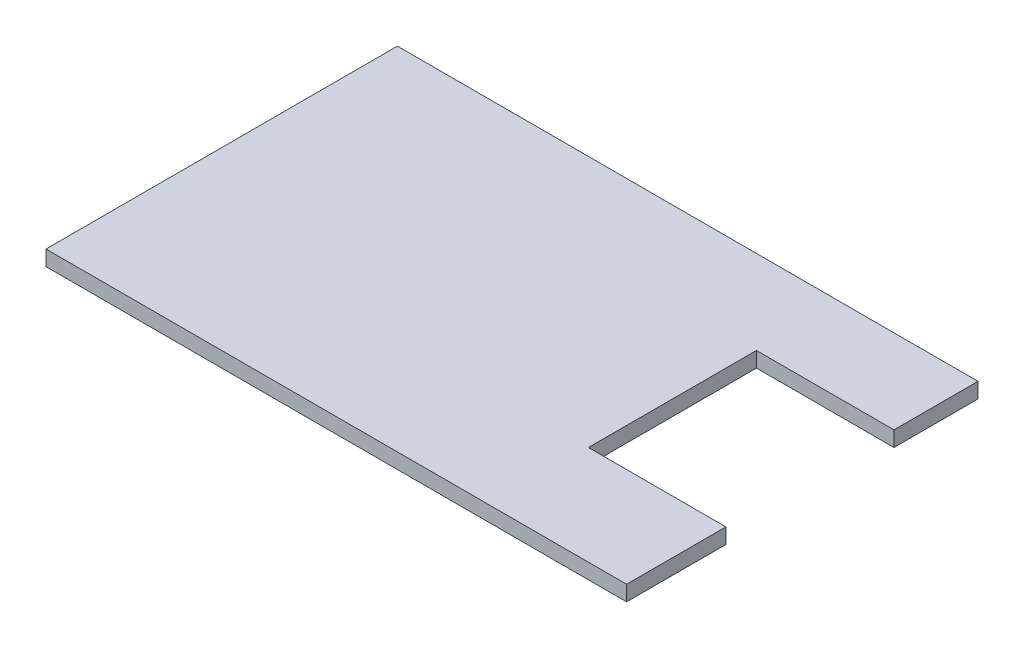
ISO-10303-21;
HEADER;
FILE_DESCRIPTION(('STEP AP214'),'2;1');
FILE_NAME('part.step','',(''),(''),'','','');
FILE_SCHEMA(('AUTOMOTIVE_DESIGN { 1 0 10303 214 1 1 1 1 }'));
ENDSEC;
DATA;
#1=APPLICATION_CONTEXT('core data for automotive mechanical design processes');
#2=APPLICATION_PROTOCOL_DEFINITION('international standard','automotive_design',2000,#1);
#3=PRODUCT_CONTEXT('',#1,'mechanical');
#4=PRODUCT('Part','Part','',(#3));
#5=PRODUCT_RELATED_PRODUCT_CATEGORY('part','',(#4));
#6=PRODUCT_DEFINITION_FORMATION('','',#4);
#7=PRODUCT_DEFINITION_CONTEXT('part definition',#1,'design');
#8=PRODUCT_DEFINITION('design','',#6,#7);
#9=PRODUCT_DEFINITION_SHAPE('','',#8);
#10=(LENGTH_UNIT() NAMED_UNIT(*) SI_UNIT(.MILLI.,.METRE.));
#11=(NAMED_UNIT(*) PLANE_ANGLE_UNIT() SI_UNIT($,.RADIAN.));
#12=(NAMED_UNIT(*) SI_UNIT($,.STERADIAN.) SOLID_ANGLE_UNIT());
#13=UNCERTAINTY_MEASURE_WITH_UNIT(LENGTH_MEASURE(1.E-05),#10,'distance_accuracy_value','');
#14=(GEOMETRIC_REPRESENTATION_CONTEXT(3) GLOBAL_UNCERTAINTY_ASSIGNED_CONTEXT((#13)) GLOBAL_UNIT_ASSIGNED_CONTEXT((#10,
#11,#12)) REPRESENTATION_CONTEXT('',''));
#15=CARTESIAN_POINT('',(0.,0.,0.));
#16=DIRECTION('',(0.,0.,1.));
#17=DIRECTION('',(1.,0.,0.));
#18=AXIS2_PLACEMENT_3D('',#15,#16,#17);
#19=CARTESIAN_POINT('',(0.,2.,0.));
#20=DIRECTION('',(1.,0.,0.));
#21=DIRECTION('',(0.,0.,-1.));
#22=AXIS2_PLACEMENT_3D('',#19,#20,#21);
#23=PLANE('',#22);
#24=DIRECTION('',(0.,0.,1.));
#25=VECTOR('',#24,1.);
#26=CARTESIAN_POINT('',(0.,0.,0.));
#27=LINE('',#26,#25);
#28=CARTESIAN_POINT('',(0.,0.,-46.));
#29=VERTEX_POINT('',#28);
#30=CARTESIAN_POINT('',(0.,0.,0.));
#31=VERTEX_POINT('',#30);
#32=EDGE_CURVE('E131',#29,#31,#27,.T.);
#33=ORIENTED_EDGE('',*,*,#32,.T.);
#34=DIRECTION('',(0.,-1.,0.));
#35=VECTOR('',#34,1.);
#36=CARTESIAN_POINT('',(0.,2.,0.));
#37=LINE('',#36,#35);
#38=CARTESIAN_POINT('',(0.,2.,0.));
#39=VERTEX_POINT('',#38);
#40=EDGE_CURVE('E11',#39,#31,#37,.T.);
#41=ORIENTED_EDGE('',*,*,#40,.F.);
#42=DIRECTION('',(0.,0.,1.));
#43=VECTOR('',#42,1.);
#44=CARTESIAN_POINT('',(0.,2.,0.));
#45=LINE('',#44,#43);
#46=CARTESIAN_POINT('',(0.,2.,-46.));
#47=VERTEX_POINT('',#46);
#48=EDGE_CURVE('E145',#47,#39,#45,.T.);
#49=ORIENTED_EDGE('',*,*,#48,.F.);
#50=DIRECTION('',(0.,-1.,0.));
#51=VECTOR('',#50,1.);
#52=CARTESIAN_POINT('',(0.,2.,-46.));
#53=LINE('',#52,#51);
#54=EDGE_CURVE('E127',#47,#29,#53,.T.);
#55=ORIENTED_EDGE('',*,*,#54,.T.);
#56=EDGE_LOOP('',(#33,#41,#49,#55));
#57=FACE_BOUND('',#56,.T.);
#58=ADVANCED_FACE('F35',(#57),#23,.F.);
#59=CARTESIAN_POINT('',(0.,2.,0.));
#60=DIRECTION('',(0.,0.,-1.));
#61=DIRECTION('',(-1.,0.,0.));
#62=AXIS2_PLACEMENT_3D('',#59,#60,#61);
#63=PLANE('',#62);
#64=DIRECTION('',(1.,0.,0.));
#65=VECTOR('',#64,1.);
#66=CARTESIAN_POINT('',(0.,0.,0.));
#67=LINE('',#66,#65);
#68=CARTESIAN_POINT('',(76.,0.,0.));
#69=VERTEX_POINT('',#68);
#70=EDGE_CURVE('E134',#31,#69,#67,.T.);
#71=ORIENTED_EDGE('',*,*,#70,.T.);
#72=DIRECTION('',(0.,-1.,0.));
#73=VECTOR('',#72,1.);
#74=CARTESIAN_POINT('',(76.,2.,0.));
#75=LINE('',#74,#73);
#76=CARTESIAN_POINT('',(76.,2.,0.));
#77=VERTEX_POINT('',#76);
#78=EDGE_CURVE('E43',#77,#69,#75,.T.);
#79=ORIENTED_EDGE('',*,*,#78,.F.);
#80=DIRECTION('',(1.,0.,0.));
#81=VECTOR('',#80,1.);
#82=CARTESIAN_POINT('',(0.,2.,0.));
#83=LINE('',#82,#81);
#84=EDGE_CURVE('E94',#39,#77,#83,.T.);
#85=ORIENTED_EDGE('',*,*,#84,.F.);
#86=ORIENTED_EDGE('',*,*,#40,.T.);
#87=EDGE_LOOP('',(#71,#79,#85,#86));
#88=FACE_BOUND('',#87,.T.);
#89=ADVANCED_FACE('F180',(#88),#63,.F.);
#90=CARTESIAN_POINT('',(76.,2.,0.));
#91=DIRECTION('',(-1.,0.,0.));
#92=DIRECTION('',(0.,0.,1.));
#93=AXIS2_PLACEMENT_3D('',#90,#91,#92);
#94=PLANE('',#93);
#95=DIRECTION('',(0.,0.,-1.));
#96=VECTOR('',#95,1.);
#97=CARTESIAN_POINT('',(76.,0.,0.));
#98=LINE('',#97,#96);
#99=CARTESIAN_POINT('',(76.,0.,-13.));
#100=VERTEX_POINT('',#99);
#101=EDGE_CURVE('E136',#69,#100,#98,.T.);
#102=ORIENTED_EDGE('',*,*,#101,.T.);
#103=DIRECTION('',(0.,-1.,0.));
#104=VECTOR('',#103,1.);
#105=CARTESIAN_POINT('',(76.,2.,-13.));
#106=LINE('',#105,#104);
#107=CARTESIAN_POINT('',(76.,2.,-13.));
#108=VERTEX_POINT('',#107);
#109=EDGE_CURVE('E152',#108,#100,#106,.T.);
#110=ORIENTED_EDGE('',*,*,#109,.F.);
#111=DIRECTION('',(0.,0.,-1.));
#112=VECTOR('',#111,1.);
#113=CARTESIAN_POINT('',(76.,2.,0.));
#114=LINE('',#113,#112);
#115=EDGE_CURVE('E160',#77,#108,#114,.T.);
#116=ORIENTED_EDGE('',*,*,#115,.F.);
#117=ORIENTED_EDGE('',*,*,#78,.T.);
#118=EDGE_LOOP('',(#102,#110,#116,#117));
#119=FACE_BOUND('',#118,.T.);
#120=ADVANCED_FACE('F158',(#119),#94,.F.);
#121=CARTESIAN_POINT('',(76.,2.,-13.));
#122=DIRECTION('',(0.,0.,1.));
#123=DIRECTION('',(1.,0.,0.));
#124=AXIS2_PLACEMENT_3D('',#121,#122,#123);
#125=PLANE('',#124);
#126=DIRECTION('',(-1.,0.,0.));
#127=VECTOR('',#126,1.);
#128=CARTESIAN_POINT('',(76.,0.,-13.));
#129=LINE('',#128,#127);
#130=CARTESIAN_POINT('',(58.,0.,-13.));
#131=VERTEX_POINT('',#130);
#132=EDGE_CURVE('E138',#100,#131,#129,.T.);
#133=ORIENTED_EDGE('',*,*,#132,.T.);
#134=DIRECTION('',(0.,-1.,0.));
#135=VECTOR('',#134,1.);
#136=CARTESIAN_POINT('',(58.,2.,-13.));
#137=LINE('',#136,#135);
#138=CARTESIAN_POINT('',(58.,2.,-13.));
#139=VERTEX_POINT('',#138);
#140=EDGE_CURVE('E149',#139,#131,#137,.T.);
#141=ORIENTED_EDGE('',*,*,#140,.F.);
#142=DIRECTION('',(-1.,0.,0.));
#143=VECTOR('',#142,1.);
#144=CARTESIAN_POINT('',(76.,2.,-13.));
#145=LINE('',#144,#143);
#146=EDGE_CURVE('E172',#108,#139,#145,.T.);
#147=ORIENTED_EDGE('',*,*,#146,.F.);
#148=ORIENTED_EDGE('',*,*,#109,.T.);
#149=EDGE_LOOP('',(#133,#141,#147,#148));
#150=FACE_BOUND('',#149,.T.);
#151=ADVANCED_FACE('F168',(#150),#125,.F.);
#152=CARTESIAN_POINT('',(58.,2.,-35.));
#153=DIRECTION('',(-1.,0.,0.));
#154=DIRECTION('',(0.,0.,1.));
#155=AXIS2_PLACEMENT_3D('',#152,#153,#154);
#156=PLANE('',#155);
#157=DIRECTION('',(0.,0.,-1.));
#158=VECTOR('',#157,1.);
#159=CARTESIAN_POINT('',(58.,0.,-35.));
#160=LINE('',#159,#158);
#161=CARTESIAN_POINT('',(58.,0.,-35.));
#162=VERTEX_POINT('',#161);
#163=EDGE_CURVE('E140',#131,#162,#160,.T.);
#164=ORIENTED_EDGE('',*,*,#163,.T.);
#165=DIRECTION('',(0.,-1.,0.));
#166=VECTOR('',#165,1.);
#167=CARTESIAN_POINT('',(58.,2.,-35.));
#168=LINE('',#167,#166);
#169=CARTESIAN_POINT('',(58.,2.,-35.));
#170=VERTEX_POINT('',#169);
#171=EDGE_CURVE('E122',#170,#162,#168,.T.);
#172=ORIENTED_EDGE('',*,*,#171,.F.);
#173=DIRECTION('',(0.,0.,-1.));
#174=VECTOR('',#173,1.);
#175=CARTESIAN_POINT('',(58.,2.,-35.));
#176=LINE('',#175,#174);
#177=EDGE_CURVE('E113',#139,#170,#176,.T.);
#178=ORIENTED_EDGE('',*,*,#177,.F.);
#179=ORIENTED_EDGE('',*,*,#140,.T.);
#180=EDGE_LOOP('',(#164,#172,#178,#179));
#181=FACE_BOUND('',#180,.T.);
#182=ADVANCED_FACE('F171',(#181),#156,.F.);
#183=CARTESIAN_POINT('',(76.,2.,-35.));
#184=DIRECTION('',(0.,0.,-1.));
#185=DIRECTION('',(-1.,0.,0.));
#186=AXIS2_PLACEMENT_3D('',#183,#184,#185);
#187=PLANE('',#186);
#188=DIRECTION('',(1.,0.,0.));
#189=VECTOR('',#188,1.);
#190=CARTESIAN_POINT('',(76.,0.,-35.));
#191=LINE('',#190,#189);
#192=CARTESIAN_POINT('',(76.,0.,-35.));
#193=VERTEX_POINT('',#192);
#194=EDGE_CURVE('E121',#162,#193,#191,.T.);
#195=ORIENTED_EDGE('',*,*,#194,.T.);
#196=DIRECTION('',(0.,-1.,0.));
#197=VECTOR('',#196,1.);
#198=CARTESIAN_POINT('',(76.,2.,-35.));
#199=LINE('',#198,#197);
#200=CARTESIAN_POINT('',(76.,2.,-35.));
#201=VERTEX_POINT('',#200);
#202=EDGE_CURVE('E118',#201,#193,#199,.T.);
#203=ORIENTED_EDGE('',*,*,#202,.F.);
#204=DIRECTION('',(1.,0.,0.));
#205=VECTOR('',#204,1.);
#206=CARTESIAN_POINT('',(76.,2.,-35.));
#207=LINE('',#206,#205);
#208=EDGE_CURVE('E107',#170,#201,#207,.T.);
#209=ORIENTED_EDGE('',*,*,#208,.F.);
#210=ORIENTED_EDGE('',*,*,#171,.T.);
#211=EDGE_LOOP('',(#195,#203,#209,#210));
#212=FACE_BOUND('',#211,.T.);
#213=ADVANCED_FACE('F119',(#212),#187,.F.);
#214=CARTESIAN_POINT('',(76.,2.,-35.));
#215=DIRECTION('',(-1.,0.,0.));
#216=DIRECTION('',(0.,0.,1.));
#217=AXIS2_PLACEMENT_3D('',#214,#215,#216);
#218=PLANE('',#217);
#219=DIRECTION('',(0.,0.,-1.));
#220=VECTOR('',#219,1.);
#221=CARTESIAN_POINT('',(76.,0.,-35.));
#222=LINE('',#221,#220);
#223=CARTESIAN_POINT('',(76.,0.,-46.));
#224=VERTEX_POINT('',#223);
#225=EDGE_CURVE('E80',#193,#224,#222,.T.);
#226=ORIENTED_EDGE('',*,*,#225,.T.);
#227=DIRECTION('',(0.,-1.,0.));
#228=VECTOR('',#227,1.);
#229=CARTESIAN_POINT('',(76.,2.,-46.));
#230=LINE('',#229,#228);
#231=CARTESIAN_POINT('',(76.,2.,-46.));
#232=VERTEX_POINT('',#231);
#233=EDGE_CURVE('E123',#232,#224,#230,.T.);
#234=ORIENTED_EDGE('',*,*,#233,.F.);
#235=DIRECTION('',(0.,0.,-1.));
#236=VECTOR('',#235,1.);
#237=CARTESIAN_POINT('',(76.,2.,-35.));
#238=LINE('',#237,#236);
#239=EDGE_CURVE('E111',#201,#232,#238,.T.);
#240=ORIENTED_EDGE('',*,*,#239,.F.);
#241=ORIENTED_EDGE('',*,*,#202,.T.);
#242=EDGE_LOOP('',(#226,#234,#240,#241));
#243=FACE_BOUND('',#242,.T.);
#244=ADVANCED_FACE('F125',(#243),#218,.F.);
#245=CARTESIAN_POINT('',(0.,2.,-46.));
#246=DIRECTION('',(0.,0.,1.));
#247=DIRECTION('',(1.,0.,0.));
#248=AXIS2_PLACEMENT_3D('',#245,#246,#247);
#249=PLANE('',#248);
#250=DIRECTION('',(-1.,0.,0.));
#251=VECTOR('',#250,1.);
#252=CARTESIAN_POINT('',(0.,0.,-46.));
#253=LINE('',#252,#251);
#254=EDGE_CURVE('E86',#224,#29,#253,.T.);
#255=ORIENTED_EDGE('',*,*,#254,.T.);
#256=ORIENTED_EDGE('',*,*,#54,.F.);
#257=DIRECTION('',(-1.,0.,0.));
#258=VECTOR('',#257,1.);
#259=CARTESIAN_POINT('',(0.,2.,-46.));
#260=LINE('',#259,#258);
#261=EDGE_CURVE('E51',#232,#47,#260,.T.);
#262=ORIENTED_EDGE('',*,*,#261,.F.);
#263=ORIENTED_EDGE('',*,*,#233,.T.);
#264=EDGE_LOOP('',(#255,#256,#262,#263));
#265=FACE_BOUND('',#264,.T.);
#266=ADVANCED_FACE('F196',(#265),#249,.F.);
#267=CARTESIAN_POINT('',(0.,2.,0.));
#268=DIRECTION('',(0.,-1.,0.));
#269=DIRECTION('',(0.,0.,-1.));
#270=AXIS2_PLACEMENT_3D('',#267,#268,#269);
#271=PLANE('',#270);
#272=ORIENTED_EDGE('',*,*,#48,.T.);
#273=ORIENTED_EDGE('',*,*,#84,.T.);
#274=ORIENTED_EDGE('',*,*,#115,.T.);
#275=ORIENTED_EDGE('',*,*,#146,.T.);
#276=ORIENTED_EDGE('',*,*,#177,.T.);
#277=ORIENTED_EDGE('',*,*,#208,.T.);
#278=ORIENTED_EDGE('',*,*,#239,.T.);
#279=ORIENTED_EDGE('',*,*,#261,.T.);
#280=EDGE_LOOP('',(#272,#273,#274,#275,#276,#277,#278,#279));
#281=FACE_BOUND('',#280,.T.);
#282=ADVANCED_FACE('F109',(#281),#271,.F.);
#283=CARTESIAN_POINT('',(0.,0.,0.));
#284=DIRECTION('',(0.,-1.,0.));
#285=DIRECTION('',(0.,0.,-1.));
#286=AXIS2_PLACEMENT_3D('',#283,#284,#285);
#287=PLANE('',#286);
#288=ORIENTED_EDGE('',*,*,#32,.F.);
#289=ORIENTED_EDGE('',*,*,#254,.F.);
#290=ORIENTED_EDGE('',*,*,#225,.F.);
#291=ORIENTED_EDGE('',*,*,#194,.F.);
#292=ORIENTED_EDGE('',*,*,#163,.F.);
#293=ORIENTED_EDGE('',*,*,#132,.F.);
#294=ORIENTED_EDGE('',*,*,#101,.F.);
#295=ORIENTED_EDGE('',*,*,#70,.F.);
#296=EDGE_LOOP('',(#288,#289,#290,#291,#292,#293,#294,#295));
#297=FACE_BOUND('',#296,.T.);
#298=ADVANCED_FACE('F164',(#297),#287,.T.);
#299=CLOSED_SHELL('',(#58,#89,#120,#151,#182,#213,#244,#266,#282,#298));
#300=MANIFOLD_SOLID_BREP('B2',#299);
#301=ADVANCED_BREP_SHAPE_REPRESENTATION('',(#18,#300),#14);
#302=SHAPE_DEFINITION_REPRESENTATION(#9,#301);
ENDSEC;
END-ISO-10303-21;
